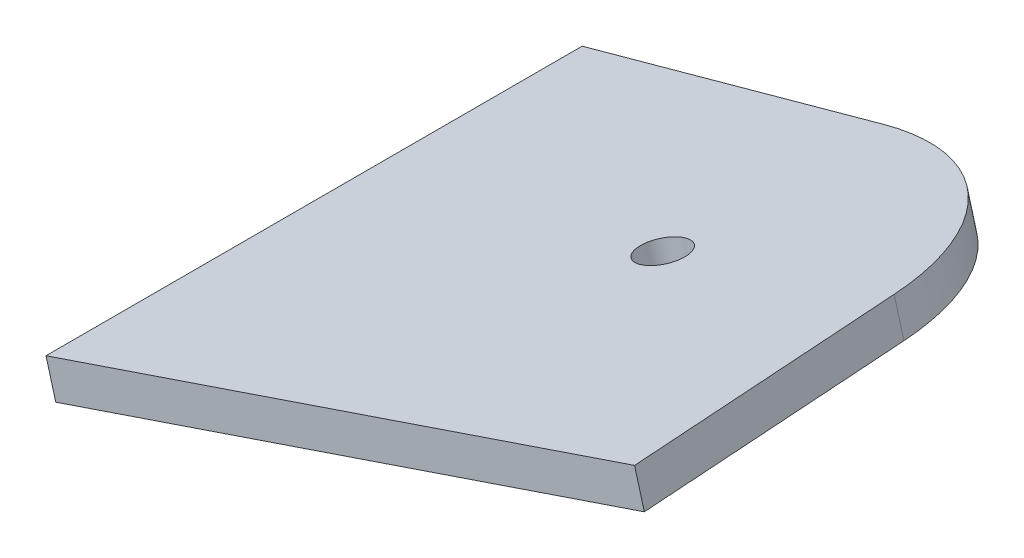
ISO-10303-21;
HEADER;
FILE_DESCRIPTION(('STEP AP214'),'2;1');
FILE_NAME('part.step','',(''),(''),'','','');
FILE_SCHEMA(('AUTOMOTIVE_DESIGN { 1 0 10303 214 1 1 1 1 }'));
ENDSEC;
DATA;
#1=APPLICATION_CONTEXT('core data for automotive mechanical design processes');
#2=APPLICATION_PROTOCOL_DEFINITION('international standard','automotive_design',2000,#1);
#3=PRODUCT_CONTEXT('',#1,'mechanical');
#4=PRODUCT('Part','Part','',(#3));
#5=PRODUCT_RELATED_PRODUCT_CATEGORY('part','',(#4));
#6=PRODUCT_DEFINITION_FORMATION('','',#4);
#7=PRODUCT_DEFINITION_CONTEXT('part definition',#1,'design');
#8=PRODUCT_DEFINITION('design','',#6,#7);
#9=PRODUCT_DEFINITION_SHAPE('','',#8);
#10=(LENGTH_UNIT() NAMED_UNIT(*) SI_UNIT(.MILLI.,.METRE.));
#11=(NAMED_UNIT(*) PLANE_ANGLE_UNIT() SI_UNIT($,.RADIAN.));
#12=(NAMED_UNIT(*) SI_UNIT($,.STERADIAN.) SOLID_ANGLE_UNIT());
#13=UNCERTAINTY_MEASURE_WITH_UNIT(LENGTH_MEASURE(1.E-05),#10,'distance_accuracy_value','');
#14=(GEOMETRIC_REPRESENTATION_CONTEXT(3) GLOBAL_UNCERTAINTY_ASSIGNED_CONTEXT((#13)) GLOBAL_UNIT_ASSIGNED_CONTEXT((#10,
#11,#12)) REPRESENTATION_CONTEXT('',''));
#15=CARTESIAN_POINT('',(0.,0.,0.));
#16=DIRECTION('',(0.,0.,1.));
#17=DIRECTION('',(1.,0.,0.));
#18=AXIS2_PLACEMENT_3D('',#15,#16,#17);
#19=CARTESIAN_POINT('',(-527.773642722156,45.7757083110269,45.804575760389));
#20=DIRECTION('',(0.960036862608029,0.264378698649397,-0.0918320539582166));
#21=DIRECTION('',(-0.265500568767691,0.964110703178859,0.));
#22=AXIS2_PLACEMENT_3D('',#19,#20,#21);
#23=PLANE('',#22);
#24=DIRECTION('',(-0.088536266116015,-0.0243814625570117,-0.995774509548129));
#25=VECTOR('',#24,1.);
#26=CARTESIAN_POINT('',(-528.448014166826,48.2245494971012,45.804575760389));
#27=LINE('',#26,#25);
#28=CARTESIAN_POINT('',(-516.533478399756,51.5056208640409,179.808318299092));
#29=VERTEX_POINT('',#28);
#30=CARTESIAN_POINT('',(-518.287558904046,51.0225753278614,160.080033715925));
#31=VERTEX_POINT('',#30);
#32=EDGE_CURVE('E116',#29,#31,#27,.T.);
#33=ORIENTED_EDGE('',*,*,#32,.F.);
#34=DIRECTION('',(-0.265500568767691,0.964110703178859,0.));
#35=VECTOR('',#34,1.);
#36=CARTESIAN_POINT('',(-515.859106955086,49.0567796779666,179.808318299092));
#37=LINE('',#36,#35);
#38=CARTESIAN_POINT('',(-515.859106955086,49.0567796779666,179.808318299092));
#39=VERTEX_POINT('',#38);
#40=EDGE_CURVE('E11',#39,#29,#37,.T.);
#41=ORIENTED_EDGE('',*,*,#40,.F.);
#42=DIRECTION('',(-0.088536266116015,-0.0243814625570117,-0.995774509548129));
#43=VECTOR('',#42,1.);
#44=CARTESIAN_POINT('',(-527.773642722156,45.7757083110269,45.804575760389));
#45=LINE('',#44,#43);
#46=CARTESIAN_POINT('',(-517.613187459376,48.5737341417871,160.080033715925));
#47=VERTEX_POINT('',#46);
#48=EDGE_CURVE('E128',#39,#47,#45,.T.);
#49=ORIENTED_EDGE('',*,*,#48,.T.);
#50=DIRECTION('',(-0.265500568767691,0.964110703178859,0.));
#51=VECTOR('',#50,1.);
#52=CARTESIAN_POINT('',(-517.613187459376,48.5737341417871,160.080033715925));
#53=LINE('',#52,#51);
#54=EDGE_CURVE('E40',#47,#31,#53,.T.);
#55=ORIENTED_EDGE('',*,*,#54,.T.);
#56=EDGE_LOOP('',(#33,#41,#49,#55));
#57=FACE_BOUND('',#56,.T.);
#58=ADVANCED_FACE('F36',(#57),#23,.T.);
#59=CARTESIAN_POINT('',(-37.0058165113826,180.925267964521,134.003742538703));
#60=DIRECTION('',(-0.0885362661160155,-0.0243814625570119,-0.995774509548129));
#61=DIRECTION('',(-0.996070613494915,0.,0.0885625932991071));
#62=AXIS2_PLACEMENT_3D('',#59,#60,#61);
#63=PLANE('',#62);
#64=DIRECTION('',(-0.960036862608029,-0.264378698649397,0.0918320539582171));
#65=VECTOR('',#64,1.);
#66=CARTESIAN_POINT('',(-37.6801879560525,183.374109150596,134.003742538703));
#67=LINE('',#66,#65);
#68=CARTESIAN_POINT('',(-553.733670771824,41.26128668075,183.366692155579));
#69=VERTEX_POINT('',#68);
#70=EDGE_CURVE('E125',#29,#69,#67,.T.);
#71=ORIENTED_EDGE('',*,*,#70,.T.);
#72=DIRECTION('',(-0.265500568767691,0.964110703178859,0.));
#73=VECTOR('',#72,1.);
#74=CARTESIAN_POINT('',(-553.059299327154,38.8124454946757,183.366692155579));
#75=LINE('',#74,#73);
#76=CARTESIAN_POINT('',(-553.059299327154,38.8124454946757,183.366692155579));
#77=VERTEX_POINT('',#76);
#78=EDGE_CURVE('E46',#77,#69,#75,.T.);
#79=ORIENTED_EDGE('',*,*,#78,.F.);
#80=DIRECTION('',(-0.960036862608029,-0.264378698649397,0.0918320539582171));
#81=VECTOR('',#80,1.);
#82=CARTESIAN_POINT('',(-37.0058165113826,180.925267964521,134.003742538703));
#83=LINE('',#82,#81);
#84=EDGE_CURVE('E108',#39,#77,#83,.T.);
#85=ORIENTED_EDGE('',*,*,#84,.F.);
#86=ORIENTED_EDGE('',*,*,#40,.T.);
#87=EDGE_LOOP('',(#71,#79,#85,#86));
#88=FACE_BOUND('',#87,.T.);
#89=ADVANCED_FACE('F132',(#88),#63,.F.);
#90=CARTESIAN_POINT('',(-553.059299327154,38.8124454946759,-1.74860126378462E-12));
#91=DIRECTION('',(-0.964110703178859,-0.265500568767691,0.));
#92=DIRECTION('',(0.265500568767691,-0.964110703178859,0.));
#93=AXIS2_PLACEMENT_3D('',#90,#91,#92);
#94=PLANE('',#93);
#95=DIRECTION('',(0.,0.,1.));
#96=VECTOR('',#95,1.);
#97=CARTESIAN_POINT('',(-553.733670771824,41.2612866807502,-1.69309011255336E-12));
#98=LINE('',#97,#96);
#99=CARTESIAN_POINT('',(-553.733670771824,41.2612866807501,146.239554218248));
#100=VERTEX_POINT('',#99);
#101=EDGE_CURVE('E94',#100,#69,#98,.T.);
#102=ORIENTED_EDGE('',*,*,#101,.F.);
#103=DIRECTION('',(-0.265500568767691,0.964110703178859,0.));
#104=VECTOR('',#103,1.);
#105=CARTESIAN_POINT('',(-553.059299327154,38.8124454946758,146.239554218248));
#106=LINE('',#105,#104);
#107=CARTESIAN_POINT('',(-553.059299327154,38.8124454946758,146.239554218248));
#108=VERTEX_POINT('',#107);
#109=EDGE_CURVE('E88',#108,#100,#106,.T.);
#110=ORIENTED_EDGE('',*,*,#109,.F.);
#111=DIRECTION('',(0.,0.,1.));
#112=VECTOR('',#111,1.);
#113=CARTESIAN_POINT('',(-553.059299327154,38.8124454946759,-1.74860126378462E-12));
#114=LINE('',#113,#112);
#115=EDGE_CURVE('E92',#108,#77,#114,.T.);
#116=ORIENTED_EDGE('',*,*,#115,.T.);
#117=ORIENTED_EDGE('',*,*,#78,.T.);
#118=EDGE_LOOP('',(#102,#110,#116,#117));
#119=FACE_BOUND('',#118,.T.);
#120=ADVANCED_FACE('F90',(#119),#94,.T.);
#121=CARTESIAN_POINT('',(-48.9203522784535,177.644196597582,146.239554218248));
#122=DIRECTION('',(0.,0.,1.));
#123=DIRECTION('',(1.,0.,0.));
#124=AXIS2_PLACEMENT_3D('',#121,#122,#123);
#125=PLANE('',#124);
#126=DIRECTION('',(0.964110703178859,0.265500568767691,0.));
#127=VECTOR('',#126,1.);
#128=CARTESIAN_POINT('',(-49.5947237231235,180.093037783656,146.239554218248));
#129=LINE('',#128,#127);
#130=CARTESIAN_POINT('',(-532.918520690192,46.9934439604446,146.239554218248));
#131=VERTEX_POINT('',#130);
#132=EDGE_CURVE('E122',#100,#131,#129,.T.);
#133=ORIENTED_EDGE('',*,*,#132,.T.);
#134=DIRECTION('',(-0.265500568767691,0.964110703178859,0.));
#135=VECTOR('',#134,1.);
#136=CARTESIAN_POINT('',(-532.244149245522,44.5446027743703,146.239554218248));
#137=LINE('',#136,#135);
#138=CARTESIAN_POINT('',(-532.244149245522,44.5446027743703,146.239554218248));
#139=VERTEX_POINT('',#138);
#140=EDGE_CURVE('E98',#139,#131,#137,.T.);
#141=ORIENTED_EDGE('',*,*,#140,.F.);
#142=DIRECTION('',(0.964110703178859,0.265500568767691,0.));
#143=VECTOR('',#142,1.);
#144=CARTESIAN_POINT('',(-48.9203522784535,177.644196597582,146.239554218248));
#145=LINE('',#144,#143);
#146=EDGE_CURVE('E101',#108,#139,#145,.T.);
#147=ORIENTED_EDGE('',*,*,#146,.F.);
#148=ORIENTED_EDGE('',*,*,#109,.T.);
#149=EDGE_LOOP('',(#133,#141,#147,#148));
#150=FACE_BOUND('',#149,.T.);
#151=ADVANCED_FACE('F102',(#150),#125,.F.);
#152=CARTESIAN_POINT('',(-532.244149245523,44.5446027743703,161.479554218248));
#153=DIRECTION('',(-0.265500568767691,0.964110703178859,0.));
#154=DIRECTION('',(-0.964110703178859,-0.265500568767691,0.));
#155=AXIS2_PLACEMENT_3D('',#152,#153,#154);
#156=CYLINDRICAL_SURFACE('',#155,1.58750000000012);
#157=CARTESIAN_POINT('',(-532.244149245523,44.5446027743703,161.479554218248));
#158=DIRECTION('',(-0.265500568767691,0.964110703178859,0.));
#159=DIRECTION('',(-0.964110703178859,-0.265500568767691,0.));
#160=AXIS2_PLACEMENT_3D('',#157,#158,#159);
#161=CIRCLE('',#160,1.58750000000012);
#162=CARTESIAN_POINT('',(-533.774674986819,44.1231206214515,161.479554218248));
#163=VERTEX_POINT('',#162);
#164=EDGE_CURVE('E126',#163,#163,#161,.T.);
#165=ORIENTED_EDGE('',*,*,#164,.F.);
#166=EDGE_LOOP('',(#165));
#167=FACE_BOUND('',#166,.T.);
#168=CARTESIAN_POINT('',(-532.918520690193,46.9934439604446,161.479554218248));
#169=DIRECTION('',(-0.265500568767691,0.964110703178859,0.));
#170=DIRECTION('',(-0.964110703178859,-0.265500568767691,0.));
#171=AXIS2_PLACEMENT_3D('',#168,#169,#170);
#172=CIRCLE('',#171,1.58750000000012);
#173=CARTESIAN_POINT('',(-534.449046431489,46.5719618075258,161.479554218248));
#174=VERTEX_POINT('',#173);
#175=EDGE_CURVE('E113',#174,#174,#172,.T.);
#176=ORIENTED_EDGE('',*,*,#175,.T.);
#177=EDGE_LOOP('',(#176));
#178=FACE_BOUND('',#177,.T.);
#179=ADVANCED_FACE('F38',(#167,#178),#156,.F.);
#180=CARTESIAN_POINT('',(-532.244149245523,44.5446027743703,161.479554218248));
#181=DIRECTION('',(-0.265500568767691,0.964110703178859,0.));
#182=DIRECTION('',(-0.964110703178859,-0.265500568767691,0.));
#183=AXIS2_PLACEMENT_3D('',#180,#181,#182);
#184=CYLINDRICAL_SURFACE('',#183,15.2400000000001);
#185=CARTESIAN_POINT('',(-532.918520690193,46.9934439604446,161.479554218248));
#186=DIRECTION('',(-0.265500568767691,0.964110703178859,0.));
#187=DIRECTION('',(-0.964110703178859,-0.265500568767691,0.));
#188=AXIS2_PLACEMENT_3D('',#185,#186,#187);
#189=CIRCLE('',#188,15.2400000000001);
#190=EDGE_CURVE('E119',#31,#131,#189,.T.);
#191=ORIENTED_EDGE('',*,*,#190,.F.);
#192=ORIENTED_EDGE('',*,*,#54,.F.);
#193=CARTESIAN_POINT('',(-532.244149245523,44.5446027743703,161.479554218248));
#194=DIRECTION('',(-0.265500568767691,0.964110703178859,0.));
#195=DIRECTION('',(-0.964110703178859,-0.265500568767691,0.));
#196=AXIS2_PLACEMENT_3D('',#193,#194,#195);
#197=CIRCLE('',#196,15.2400000000001);
#198=EDGE_CURVE('E104',#47,#139,#197,.T.);
#199=ORIENTED_EDGE('',*,*,#198,.T.);
#200=ORIENTED_EDGE('',*,*,#140,.T.);
#201=EDGE_LOOP('',(#191,#192,#199,#200));
#202=FACE_BOUND('',#201,.T.);
#203=ADVANCED_FACE('F129',(#202),#184,.T.);
#204=CARTESIAN_POINT('',(-48.9203522784534,177.644196597582,-1.11022302462516E-13));
#205=DIRECTION('',(-0.265500568767691,0.964110703178859,0.));
#206=DIRECTION('',(-0.964110703178859,-0.265500568767691,0.));
#207=AXIS2_PLACEMENT_3D('',#204,#205,#206);
#208=PLANE('',#207);
#209=ORIENTED_EDGE('',*,*,#164,.T.);
#210=EDGE_LOOP('',(#209));
#211=FACE_BOUND('',#210,.T.);
#212=ORIENTED_EDGE('',*,*,#48,.F.);
#213=ORIENTED_EDGE('',*,*,#84,.T.);
#214=ORIENTED_EDGE('',*,*,#115,.F.);
#215=ORIENTED_EDGE('',*,*,#146,.T.);
#216=ORIENTED_EDGE('',*,*,#198,.F.);
#217=EDGE_LOOP('',(#212,#213,#214,#215,#216));
#218=FACE_BOUND('',#217,.T.);
#219=ADVANCED_FACE('F107',(#211,#218),#208,.F.);
#220=CARTESIAN_POINT('',(-49.5947237231235,180.093037783656,-1.11022302462516E-13));
#221=DIRECTION('',(-0.265500568767691,0.964110703178859,0.));
#222=DIRECTION('',(-0.964110703178859,-0.265500568767691,0.));
#223=AXIS2_PLACEMENT_3D('',#220,#221,#222);
#224=PLANE('',#223);
#225=ORIENTED_EDGE('',*,*,#175,.F.);
#226=EDGE_LOOP('',(#225));
#227=FACE_BOUND('',#226,.T.);
#228=ORIENTED_EDGE('',*,*,#32,.T.);
#229=ORIENTED_EDGE('',*,*,#190,.T.);
#230=ORIENTED_EDGE('',*,*,#132,.F.);
#231=ORIENTED_EDGE('',*,*,#101,.T.);
#232=ORIENTED_EDGE('',*,*,#70,.F.);
#233=EDGE_LOOP('',(#228,#229,#230,#231,#232));
#234=FACE_BOUND('',#233,.T.);
#235=ADVANCED_FACE('F131',(#227,#234),#224,.T.);
#236=CLOSED_SHELL('',(#58,#89,#120,#151,#179,#203,#219,#235));
#237=MANIFOLD_SOLID_BREP('B2',#236);
#238=ADVANCED_BREP_SHAPE_REPRESENTATION('',(#18,#237),#14);
#239=SHAPE_DEFINITION_REPRESENTATION(#9,#238);
ENDSEC;
END-ISO-10303-21;
